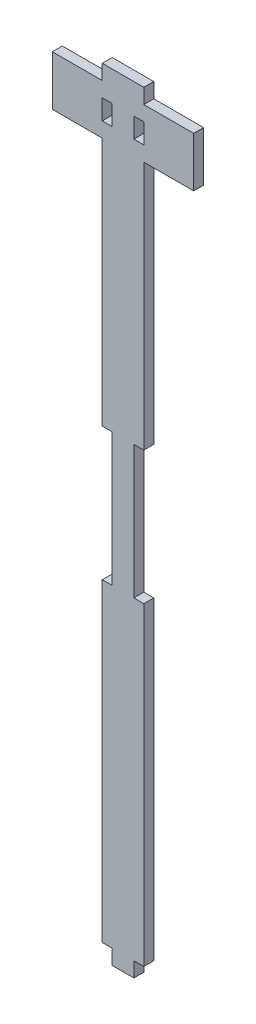
ISO-10303-21;
HEADER;
FILE_DESCRIPTION(('STEP AP214'),'2;1');
FILE_NAME('part.step','',(''),(''),'','','');
FILE_SCHEMA(('AUTOMOTIVE_DESIGN { 1 0 10303 214 1 1 1 1 }'));
ENDSEC;
DATA;
#1=APPLICATION_CONTEXT('core data for automotive mechanical design processes');
#2=APPLICATION_PROTOCOL_DEFINITION('international standard','automotive_design',2000,#1);
#3=PRODUCT_CONTEXT('',#1,'mechanical');
#4=PRODUCT('Part','Part','',(#3));
#5=PRODUCT_RELATED_PRODUCT_CATEGORY('part','',(#4));
#6=PRODUCT_DEFINITION_FORMATION('','',#4);
#7=PRODUCT_DEFINITION_CONTEXT('part definition',#1,'design');
#8=PRODUCT_DEFINITION('design','',#6,#7);
#9=PRODUCT_DEFINITION_SHAPE('','',#8);
#10=(LENGTH_UNIT() NAMED_UNIT(*) SI_UNIT(.MILLI.,.METRE.));
#11=(NAMED_UNIT(*) PLANE_ANGLE_UNIT() SI_UNIT($,.RADIAN.));
#12=(NAMED_UNIT(*) SI_UNIT($,.STERADIAN.) SOLID_ANGLE_UNIT());
#13=UNCERTAINTY_MEASURE_WITH_UNIT(LENGTH_MEASURE(1.E-05),#10,'distance_accuracy_value','');
#14=(GEOMETRIC_REPRESENTATION_CONTEXT(3) GLOBAL_UNCERTAINTY_ASSIGNED_CONTEXT((#13)) GLOBAL_UNIT_ASSIGNED_CONTEXT((#10,
#11,#12)) REPRESENTATION_CONTEXT('',''));
#15=CARTESIAN_POINT('',(0.,0.,0.));
#16=DIRECTION('',(0.,0.,1.));
#17=DIRECTION('',(1.,0.,0.));
#18=AXIS2_PLACEMENT_3D('',#15,#16,#17);
#19=CARTESIAN_POINT('',(0.,0.,3.));
#20=DIRECTION('',(0.,0.,1.));
#21=DIRECTION('',(1.,0.,0.));
#22=AXIS2_PLACEMENT_3D('',#19,#20,#21);
#23=PLANE('',#22);
#24=DIRECTION('',(1.,0.,0.));
#25=VECTOR('',#24,1.);
#26=CARTESIAN_POINT('',(6.37843131465865,-114.5,3.));
#27=LINE('',#26,#25);
#28=CARTESIAN_POINT('',(3.37843131465854,-114.5,3.));
#29=VERTEX_POINT('',#28);
#30=CARTESIAN_POINT('',(6.37843131465865,-114.5,3.));
#31=VERTEX_POINT('',#30);
#32=EDGE_CURVE('E314',#29,#31,#27,.T.);
#33=ORIENTED_EDGE('',*,*,#32,.T.);
#34=DIRECTION('',(0.,1.,0.));
#35=VECTOR('',#34,1.);
#36=CARTESIAN_POINT('',(6.37843131465865,-20.,3.));
#37=LINE('',#36,#35);
#38=CARTESIAN_POINT('',(6.37843131465865,-20.,3.));
#39=VERTEX_POINT('',#38);
#40=EDGE_CURVE('E317',#31,#39,#37,.T.);
#41=ORIENTED_EDGE('',*,*,#40,.T.);
#42=DIRECTION('',(-1.,0.,0.));
#43=VECTOR('',#42,1.);
#44=CARTESIAN_POINT('',(3.37843131465865,-20.,3.));
#45=LINE('',#44,#43);
#46=CARTESIAN_POINT('',(3.37843131465865,-20.,3.));
#47=VERTEX_POINT('',#46);
#48=EDGE_CURVE('E320',#39,#47,#45,.T.);
#49=ORIENTED_EDGE('',*,*,#48,.T.);
#50=DIRECTION('',(0.,1.,0.));
#51=VECTOR('',#50,1.);
#52=CARTESIAN_POINT('',(3.37843131465865,20.,3.));
#53=LINE('',#52,#51);
#54=CARTESIAN_POINT('',(3.37843131465865,20.,3.));
#55=VERTEX_POINT('',#54);
#56=EDGE_CURVE('E322',#47,#55,#53,.T.);
#57=ORIENTED_EDGE('',*,*,#56,.T.);
#58=DIRECTION('',(1.,0.,0.));
#59=VECTOR('',#58,1.);
#60=CARTESIAN_POINT('',(6.37843131465871,20.,3.));
#61=LINE('',#60,#59);
#62=CARTESIAN_POINT('',(6.37843131465871,20.,3.));
#63=VERTEX_POINT('',#62);
#64=EDGE_CURVE('E324',#55,#63,#61,.T.);
#65=ORIENTED_EDGE('',*,*,#64,.T.);
#66=DIRECTION('',(0.,1.,0.));
#67=VECTOR('',#66,1.);
#68=CARTESIAN_POINT('',(6.37843131465871,95.,3.));
#69=LINE('',#68,#67);
#70=CARTESIAN_POINT('',(6.37843131465871,95.,3.));
#71=VERTEX_POINT('',#70);
#72=EDGE_CURVE('E326',#63,#71,#69,.T.);
#73=ORIENTED_EDGE('',*,*,#72,.T.);
#74=DIRECTION('',(1.,0.,0.));
#75=VECTOR('',#74,1.);
#76=CARTESIAN_POINT('',(6.37843131465871,95.,3.));
#77=LINE('',#76,#75);
#78=CARTESIAN_POINT('',(21.3784313146587,95.,3.));
#79=VERTEX_POINT('',#78);
#80=EDGE_CURVE('E328',#71,#79,#77,.T.);
#81=ORIENTED_EDGE('',*,*,#80,.T.);
#82=DIRECTION('',(0.,1.,0.));
#83=VECTOR('',#82,1.);
#84=CARTESIAN_POINT('',(21.3784313146587,110.,3.));
#85=LINE('',#84,#83);
#86=CARTESIAN_POINT('',(21.3784313146587,110.,3.));
#87=VERTEX_POINT('',#86);
#88=EDGE_CURVE('E330',#79,#87,#85,.T.);
#89=ORIENTED_EDGE('',*,*,#88,.T.);
#90=DIRECTION('',(-1.,0.,0.));
#91=VECTOR('',#90,1.);
#92=CARTESIAN_POINT('',(6.37843131465871,110.,3.));
#93=LINE('',#92,#91);
#94=CARTESIAN_POINT('',(6.37843131465871,110.,3.));
#95=VERTEX_POINT('',#94);
#96=EDGE_CURVE('E332',#87,#95,#93,.T.);
#97=ORIENTED_EDGE('',*,*,#96,.T.);
#98=DIRECTION('',(0.,1.,0.));
#99=VECTOR('',#98,1.);
#100=CARTESIAN_POINT('',(6.37843131465871,110.,3.));
#101=LINE('',#100,#99);
#102=CARTESIAN_POINT('',(6.37843131465871,114.5,3.));
#103=VERTEX_POINT('',#102);
#104=EDGE_CURVE('E334',#95,#103,#101,.T.);
#105=ORIENTED_EDGE('',*,*,#104,.T.);
#106=DIRECTION('',(-1.,0.,0.));
#107=VECTOR('',#106,1.);
#108=CARTESIAN_POINT('',(6.37843131465871,114.5,3.));
#109=LINE('',#108,#107);
#110=CARTESIAN_POINT('',(-6.12156868534136,114.5,3.));
#111=VERTEX_POINT('',#110);
#112=EDGE_CURVE('E336',#103,#111,#109,.T.);
#113=ORIENTED_EDGE('',*,*,#112,.T.);
#114=DIRECTION('',(0.,-1.,0.));
#115=VECTOR('',#114,1.);
#116=CARTESIAN_POINT('',(-6.12156868534136,114.5,3.));
#117=LINE('',#116,#115);
#118=CARTESIAN_POINT('',(-6.12156868534136,110.,3.));
#119=VERTEX_POINT('',#118);
#120=EDGE_CURVE('E338',#111,#119,#117,.T.);
#121=ORIENTED_EDGE('',*,*,#120,.T.);
#122=DIRECTION('',(-1.,0.,0.));
#123=VECTOR('',#122,1.);
#124=CARTESIAN_POINT('',(-21.1215686853414,110.,3.));
#125=LINE('',#124,#123);
#126=CARTESIAN_POINT('',(-21.1215686853414,110.,3.));
#127=VERTEX_POINT('',#126);
#128=EDGE_CURVE('E340',#119,#127,#125,.T.);
#129=ORIENTED_EDGE('',*,*,#128,.T.);
#130=DIRECTION('',(0.,-1.,0.));
#131=VECTOR('',#130,1.);
#132=CARTESIAN_POINT('',(-21.1215686853414,95.,3.));
#133=LINE('',#132,#131);
#134=CARTESIAN_POINT('',(-21.1215686853414,95.,3.));
#135=VERTEX_POINT('',#134);
#136=EDGE_CURVE('E342',#127,#135,#133,.T.);
#137=ORIENTED_EDGE('',*,*,#136,.T.);
#138=DIRECTION('',(1.,0.,0.));
#139=VECTOR('',#138,1.);
#140=CARTESIAN_POINT('',(-21.1215686853414,95.,3.));
#141=LINE('',#140,#139);
#142=CARTESIAN_POINT('',(-6.12156868534136,95.,3.));
#143=VERTEX_POINT('',#142);
#144=EDGE_CURVE('E344',#135,#143,#141,.T.);
#145=ORIENTED_EDGE('',*,*,#144,.T.);
#146=DIRECTION('',(0.,-1.,0.));
#147=VECTOR('',#146,1.);
#148=CARTESIAN_POINT('',(-6.12156868534136,20.,3.));
#149=LINE('',#148,#147);
#150=CARTESIAN_POINT('',(-6.12156868534136,20.,3.));
#151=VERTEX_POINT('',#150);
#152=EDGE_CURVE('E346',#143,#151,#149,.T.);
#153=ORIENTED_EDGE('',*,*,#152,.T.);
#154=DIRECTION('',(1.,0.,0.));
#155=VECTOR('',#154,1.);
#156=CARTESIAN_POINT('',(-6.12156868534136,20.,3.));
#157=LINE('',#156,#155);
#158=CARTESIAN_POINT('',(-3.12156868534152,20.,3.));
#159=VERTEX_POINT('',#158);
#160=EDGE_CURVE('E348',#151,#159,#157,.T.);
#161=ORIENTED_EDGE('',*,*,#160,.T.);
#162=DIRECTION('',(0.,-1.,0.));
#163=VECTOR('',#162,1.);
#164=CARTESIAN_POINT('',(-3.12156868534152,20.,3.));
#165=LINE('',#164,#163);
#166=CARTESIAN_POINT('',(-3.12156868534152,-20.,3.));
#167=VERTEX_POINT('',#166);
#168=EDGE_CURVE('E350',#159,#167,#165,.T.);
#169=ORIENTED_EDGE('',*,*,#168,.T.);
#170=DIRECTION('',(-1.,0.,0.));
#171=VECTOR('',#170,1.);
#172=CARTESIAN_POINT('',(-3.12156868534152,-20.,3.));
#173=LINE('',#172,#171);
#174=CARTESIAN_POINT('',(-6.12156868534147,-20.,3.));
#175=VERTEX_POINT('',#174);
#176=EDGE_CURVE('E352',#167,#175,#173,.T.);
#177=ORIENTED_EDGE('',*,*,#176,.T.);
#178=DIRECTION('',(0.,-1.,0.));
#179=VECTOR('',#178,1.);
#180=CARTESIAN_POINT('',(-6.12156868534147,-20.,3.));
#181=LINE('',#180,#179);
#182=CARTESIAN_POINT('',(-6.12156868534147,-114.5,3.));
#183=VERTEX_POINT('',#182);
#184=EDGE_CURVE('E354',#175,#183,#181,.T.);
#185=ORIENTED_EDGE('',*,*,#184,.T.);
#186=DIRECTION('',(1.,0.,0.));
#187=VECTOR('',#186,1.);
#188=CARTESIAN_POINT('',(-3.12156868534147,-114.5,3.));
#189=LINE('',#188,#187);
#190=CARTESIAN_POINT('',(-3.12156868534147,-114.5,3.));
#191=VERTEX_POINT('',#190);
#192=EDGE_CURVE('E356',#183,#191,#189,.T.);
#193=ORIENTED_EDGE('',*,*,#192,.T.);
#194=DIRECTION('',(0.,-1.,0.));
#195=VECTOR('',#194,1.);
#196=CARTESIAN_POINT('',(-3.12156868534147,-119.,3.));
#197=LINE('',#196,#195);
#198=CARTESIAN_POINT('',(-3.12156868534147,-119.,3.));
#199=VERTEX_POINT('',#198);
#200=EDGE_CURVE('E358',#191,#199,#197,.T.);
#201=ORIENTED_EDGE('',*,*,#200,.T.);
#202=DIRECTION('',(1.,0.,0.));
#203=VECTOR('',#202,1.);
#204=CARTESIAN_POINT('',(3.37843131465854,-119.,3.));
#205=LINE('',#204,#203);
#206=CARTESIAN_POINT('',(3.37843131465854,-119.,3.));
#207=VERTEX_POINT('',#206);
#208=EDGE_CURVE('E360',#199,#207,#205,.T.);
#209=ORIENTED_EDGE('',*,*,#208,.T.);
#210=DIRECTION('',(0.,1.,0.));
#211=VECTOR('',#210,1.);
#212=CARTESIAN_POINT('',(3.37843131465854,-114.5,3.));
#213=LINE('',#212,#211);
#214=EDGE_CURVE('E362',#207,#29,#213,.T.);
#215=ORIENTED_EDGE('',*,*,#214,.T.);
#216=EDGE_LOOP('',(#33,#41,#49,#57,#65,#73,#81,#89,#97,#105,#113,#121,#129,#137,#145,#153,#161,
#169,#177,#185,#193,#201,#209,#215));
#217=FACE_BOUND('',#216,.T.);
#218=DIRECTION('',(0.,1.,0.));
#219=VECTOR('',#218,1.);
#220=CARTESIAN_POINT('',(6.37843131465871,99.5,3.));
#221=LINE('',#220,#219);
#222=CARTESIAN_POINT('',(6.37843131465871,99.5,3.));
#223=VERTEX_POINT('',#222);
#224=CARTESIAN_POINT('',(6.37843131465871,105.5,3.));
#225=VERTEX_POINT('',#224);
#226=EDGE_CURVE('E285',#223,#225,#221,.T.);
#227=ORIENTED_EDGE('',*,*,#226,.F.);
#228=DIRECTION('',(1.,0.,0.));
#229=VECTOR('',#228,1.);
#230=CARTESIAN_POINT('',(6.37843131465871,99.5,3.));
#231=LINE('',#230,#229);
#232=CARTESIAN_POINT('',(3.3784313146587,99.5,3.));
#233=VERTEX_POINT('',#232);
#234=EDGE_CURVE('E283',#233,#223,#231,.T.);
#235=ORIENTED_EDGE('',*,*,#234,.F.);
#236=DIRECTION('',(0.,-1.,0.));
#237=VECTOR('',#236,1.);
#238=CARTESIAN_POINT('',(3.3784313146587,105.5,3.));
#239=LINE('',#238,#237);
#240=CARTESIAN_POINT('',(3.3784313146587,105.5,3.));
#241=VERTEX_POINT('',#240);
#242=EDGE_CURVE('E291',#241,#233,#239,.T.);
#243=ORIENTED_EDGE('',*,*,#242,.F.);
#244=DIRECTION('',(-1.,0.,0.));
#245=VECTOR('',#244,1.);
#246=CARTESIAN_POINT('',(6.37843131465871,105.5,3.));
#247=LINE('',#246,#245);
#248=EDGE_CURVE('E288',#225,#241,#247,.T.);
#249=ORIENTED_EDGE('',*,*,#248,.F.);
#250=EDGE_LOOP('',(#227,#235,#243,#249));
#251=FACE_BOUND('',#250,.T.);
#252=DIRECTION('',(1.,0.,0.));
#253=VECTOR('',#252,1.);
#254=CARTESIAN_POINT('',(-6.12156868534136,99.5,3.));
#255=LINE('',#254,#253);
#256=CARTESIAN_POINT('',(-6.12156868534136,99.5,3.));
#257=VERTEX_POINT('',#256);
#258=CARTESIAN_POINT('',(-3.12156868534136,99.5,3.));
#259=VERTEX_POINT('',#258);
#260=EDGE_CURVE('E255',#257,#259,#255,.T.);
#261=ORIENTED_EDGE('',*,*,#260,.F.);
#262=DIRECTION('',(0.,-1.,0.));
#263=VECTOR('',#262,1.);
#264=CARTESIAN_POINT('',(-6.12156868534136,99.5,3.));
#265=LINE('',#264,#263);
#266=CARTESIAN_POINT('',(-6.12156868534136,105.5,3.));
#267=VERTEX_POINT('',#266);
#268=EDGE_CURVE('E247',#267,#257,#265,.T.);
#269=ORIENTED_EDGE('',*,*,#268,.F.);
#270=DIRECTION('',(-1.,0.,0.));
#271=VECTOR('',#270,1.);
#272=CARTESIAN_POINT('',(-6.12156868534136,105.5,3.));
#273=LINE('',#272,#271);
#274=CARTESIAN_POINT('',(-3.12156868534136,105.5,3.));
#275=VERTEX_POINT('',#274);
#276=EDGE_CURVE('E269',#275,#267,#273,.T.);
#277=ORIENTED_EDGE('',*,*,#276,.F.);
#278=DIRECTION('',(0.,1.,0.));
#279=VECTOR('',#278,1.);
#280=CARTESIAN_POINT('',(-3.12156868534136,105.5,3.));
#281=LINE('',#280,#279);
#282=EDGE_CURVE('E267',#259,#275,#281,.T.);
#283=ORIENTED_EDGE('',*,*,#282,.F.);
#284=EDGE_LOOP('',(#261,#269,#277,#283));
#285=FACE_BOUND('',#284,.T.);
#286=ADVANCED_FACE('F38',(#217,#251,#285),#23,.T.);
#287=CARTESIAN_POINT('',(0.,0.,0.));
#288=DIRECTION('',(0.,0.,1.));
#289=DIRECTION('',(1.,0.,0.));
#290=AXIS2_PLACEMENT_3D('',#287,#288,#289);
#291=PLANE('',#290);
#292=DIRECTION('',(1.,0.,0.));
#293=VECTOR('',#292,1.);
#294=CARTESIAN_POINT('',(6.37843131465871,99.5,0.));
#295=LINE('',#294,#293);
#296=CARTESIAN_POINT('',(3.3784313146587,99.5,0.));
#297=VERTEX_POINT('',#296);
#298=CARTESIAN_POINT('',(6.37843131465871,99.5,0.));
#299=VERTEX_POINT('',#298);
#300=EDGE_CURVE('E263',#297,#299,#295,.T.);
#301=ORIENTED_EDGE('',*,*,#300,.T.);
#302=DIRECTION('',(0.,1.,0.));
#303=VECTOR('',#302,1.);
#304=CARTESIAN_POINT('',(6.37843131465871,99.5,0.));
#305=LINE('',#304,#303);
#306=CARTESIAN_POINT('',(6.37843131465871,105.5,0.));
#307=VERTEX_POINT('',#306);
#308=EDGE_CURVE('E296',#299,#307,#305,.T.);
#309=ORIENTED_EDGE('',*,*,#308,.T.);
#310=DIRECTION('',(-1.,0.,0.));
#311=VECTOR('',#310,1.);
#312=CARTESIAN_POINT('',(6.37843131465871,105.5,0.));
#313=LINE('',#312,#311);
#314=CARTESIAN_POINT('',(3.3784313146587,105.5,0.));
#315=VERTEX_POINT('',#314);
#316=EDGE_CURVE('E299',#307,#315,#313,.T.);
#317=ORIENTED_EDGE('',*,*,#316,.T.);
#318=DIRECTION('',(0.,-1.,0.));
#319=VECTOR('',#318,1.);
#320=CARTESIAN_POINT('',(3.3784313146587,105.5,0.));
#321=LINE('',#320,#319);
#322=EDGE_CURVE('E286',#315,#297,#321,.T.);
#323=ORIENTED_EDGE('',*,*,#322,.T.);
#324=EDGE_LOOP('',(#301,#309,#317,#323));
#325=FACE_BOUND('',#324,.T.);
#326=DIRECTION('',(1.,0.,0.));
#327=VECTOR('',#326,1.);
#328=CARTESIAN_POINT('',(6.37843131465865,-114.5,0.));
#329=LINE('',#328,#327);
#330=CARTESIAN_POINT('',(3.37843131465854,-114.5,0.));
#331=VERTEX_POINT('',#330);
#332=CARTESIAN_POINT('',(6.37843131465865,-114.5,0.));
#333=VERTEX_POINT('',#332);
#334=EDGE_CURVE('E313',#331,#333,#329,.T.);
#335=ORIENTED_EDGE('',*,*,#334,.F.);
#336=DIRECTION('',(0.,1.,0.));
#337=VECTOR('',#336,1.);
#338=CARTESIAN_POINT('',(3.37843131465854,-114.5,0.));
#339=LINE('',#338,#337);
#340=CARTESIAN_POINT('',(3.37843131465854,-119.,0.));
#341=VERTEX_POINT('',#340);
#342=EDGE_CURVE('E318',#341,#331,#339,.T.);
#343=ORIENTED_EDGE('',*,*,#342,.F.);
#344=DIRECTION('',(1.,0.,0.));
#345=VECTOR('',#344,1.);
#346=CARTESIAN_POINT('',(3.37843131465854,-119.,0.));
#347=LINE('',#346,#345);
#348=CARTESIAN_POINT('',(-3.12156868534147,-119.,0.));
#349=VERTEX_POINT('',#348);
#350=EDGE_CURVE('E409',#349,#341,#347,.T.);
#351=ORIENTED_EDGE('',*,*,#350,.F.);
#352=DIRECTION('',(0.,-1.,0.));
#353=VECTOR('',#352,1.);
#354=CARTESIAN_POINT('',(-3.12156868534147,-119.,0.));
#355=LINE('',#354,#353);
#356=CARTESIAN_POINT('',(-3.12156868534147,-114.5,0.));
#357=VERTEX_POINT('',#356);
#358=EDGE_CURVE('E407',#357,#349,#355,.T.);
#359=ORIENTED_EDGE('',*,*,#358,.F.);
#360=DIRECTION('',(1.,0.,0.));
#361=VECTOR('',#360,1.);
#362=CARTESIAN_POINT('',(-3.12156868534147,-114.5,0.));
#363=LINE('',#362,#361);
#364=CARTESIAN_POINT('',(-6.12156868534147,-114.5,0.));
#365=VERTEX_POINT('',#364);
#366=EDGE_CURVE('E405',#365,#357,#363,.T.);
#367=ORIENTED_EDGE('',*,*,#366,.F.);
#368=DIRECTION('',(0.,-1.,0.));
#369=VECTOR('',#368,1.);
#370=CARTESIAN_POINT('',(-6.12156868534147,-20.,0.));
#371=LINE('',#370,#369);
#372=CARTESIAN_POINT('',(-6.12156868534147,-20.,0.));
#373=VERTEX_POINT('',#372);
#374=EDGE_CURVE('E403',#373,#365,#371,.T.);
#375=ORIENTED_EDGE('',*,*,#374,.F.);
#376=DIRECTION('',(-1.,0.,0.));
#377=VECTOR('',#376,1.);
#378=CARTESIAN_POINT('',(-3.12156868534152,-20.,0.));
#379=LINE('',#378,#377);
#380=CARTESIAN_POINT('',(-3.12156868534152,-20.,0.));
#381=VERTEX_POINT('',#380);
#382=EDGE_CURVE('E401',#381,#373,#379,.T.);
#383=ORIENTED_EDGE('',*,*,#382,.F.);
#384=DIRECTION('',(0.,-1.,0.));
#385=VECTOR('',#384,1.);
#386=CARTESIAN_POINT('',(-3.12156868534152,20.,0.));
#387=LINE('',#386,#385);
#388=CARTESIAN_POINT('',(-3.12156868534152,20.,0.));
#389=VERTEX_POINT('',#388);
#390=EDGE_CURVE('E399',#389,#381,#387,.T.);
#391=ORIENTED_EDGE('',*,*,#390,.F.);
#392=DIRECTION('',(1.,0.,0.));
#393=VECTOR('',#392,1.);
#394=CARTESIAN_POINT('',(-6.12156868534136,20.,0.));
#395=LINE('',#394,#393);
#396=CARTESIAN_POINT('',(-6.12156868534136,20.,0.));
#397=VERTEX_POINT('',#396);
#398=EDGE_CURVE('E397',#397,#389,#395,.T.);
#399=ORIENTED_EDGE('',*,*,#398,.F.);
#400=DIRECTION('',(0.,-1.,0.));
#401=VECTOR('',#400,1.);
#402=CARTESIAN_POINT('',(-6.12156868534136,20.,0.));
#403=LINE('',#402,#401);
#404=CARTESIAN_POINT('',(-6.12156868534136,95.,0.));
#405=VERTEX_POINT('',#404);
#406=EDGE_CURVE('E395',#405,#397,#403,.T.);
#407=ORIENTED_EDGE('',*,*,#406,.F.);
#408=DIRECTION('',(1.,0.,0.));
#409=VECTOR('',#408,1.);
#410=CARTESIAN_POINT('',(-21.1215686853414,95.,0.));
#411=LINE('',#410,#409);
#412=CARTESIAN_POINT('',(-21.1215686853414,95.,0.));
#413=VERTEX_POINT('',#412);
#414=EDGE_CURVE('E393',#413,#405,#411,.T.);
#415=ORIENTED_EDGE('',*,*,#414,.F.);
#416=DIRECTION('',(0.,-1.,0.));
#417=VECTOR('',#416,1.);
#418=CARTESIAN_POINT('',(-21.1215686853414,95.,0.));
#419=LINE('',#418,#417);
#420=CARTESIAN_POINT('',(-21.1215686853414,110.,0.));
#421=VERTEX_POINT('',#420);
#422=EDGE_CURVE('E391',#421,#413,#419,.T.);
#423=ORIENTED_EDGE('',*,*,#422,.F.);
#424=DIRECTION('',(-1.,0.,0.));
#425=VECTOR('',#424,1.);
#426=CARTESIAN_POINT('',(-21.1215686853414,110.,0.));
#427=LINE('',#426,#425);
#428=CARTESIAN_POINT('',(-6.12156868534136,110.,0.));
#429=VERTEX_POINT('',#428);
#430=EDGE_CURVE('E389',#429,#421,#427,.T.);
#431=ORIENTED_EDGE('',*,*,#430,.F.);
#432=DIRECTION('',(0.,-1.,0.));
#433=VECTOR('',#432,1.);
#434=CARTESIAN_POINT('',(-6.12156868534136,114.5,0.));
#435=LINE('',#434,#433);
#436=CARTESIAN_POINT('',(-6.12156868534136,114.5,0.));
#437=VERTEX_POINT('',#436);
#438=EDGE_CURVE('E387',#437,#429,#435,.T.);
#439=ORIENTED_EDGE('',*,*,#438,.F.);
#440=DIRECTION('',(-1.,0.,0.));
#441=VECTOR('',#440,1.);
#442=CARTESIAN_POINT('',(6.37843131465871,114.5,0.));
#443=LINE('',#442,#441);
#444=CARTESIAN_POINT('',(6.37843131465871,114.5,0.));
#445=VERTEX_POINT('',#444);
#446=EDGE_CURVE('E385',#445,#437,#443,.T.);
#447=ORIENTED_EDGE('',*,*,#446,.F.);
#448=DIRECTION('',(0.,1.,0.));
#449=VECTOR('',#448,1.);
#450=CARTESIAN_POINT('',(6.37843131465871,110.,0.));
#451=LINE('',#450,#449);
#452=CARTESIAN_POINT('',(6.37843131465871,110.,0.));
#453=VERTEX_POINT('',#452);
#454=EDGE_CURVE('E383',#453,#445,#451,.T.);
#455=ORIENTED_EDGE('',*,*,#454,.F.);
#456=DIRECTION('',(-1.,0.,0.));
#457=VECTOR('',#456,1.);
#458=CARTESIAN_POINT('',(6.37843131465871,110.,0.));
#459=LINE('',#458,#457);
#460=CARTESIAN_POINT('',(21.3784313146587,110.,0.));
#461=VERTEX_POINT('',#460);
#462=EDGE_CURVE('E381',#461,#453,#459,.T.);
#463=ORIENTED_EDGE('',*,*,#462,.F.);
#464=DIRECTION('',(0.,1.,0.));
#465=VECTOR('',#464,1.);
#466=CARTESIAN_POINT('',(21.3784313146587,110.,0.));
#467=LINE('',#466,#465);
#468=CARTESIAN_POINT('',(21.3784313146587,95.,0.));
#469=VERTEX_POINT('',#468);
#470=EDGE_CURVE('E379',#469,#461,#467,.T.);
#471=ORIENTED_EDGE('',*,*,#470,.F.);
#472=DIRECTION('',(1.,0.,0.));
#473=VECTOR('',#472,1.);
#474=CARTESIAN_POINT('',(6.37843131465871,95.,0.));
#475=LINE('',#474,#473);
#476=CARTESIAN_POINT('',(6.37843131465871,95.,0.));
#477=VERTEX_POINT('',#476);
#478=EDGE_CURVE('E377',#477,#469,#475,.T.);
#479=ORIENTED_EDGE('',*,*,#478,.F.);
#480=DIRECTION('',(0.,1.,0.));
#481=VECTOR('',#480,1.);
#482=CARTESIAN_POINT('',(6.37843131465871,95.,0.));
#483=LINE('',#482,#481);
#484=CARTESIAN_POINT('',(6.37843131465871,20.,0.));
#485=VERTEX_POINT('',#484);
#486=EDGE_CURVE('E375',#485,#477,#483,.T.);
#487=ORIENTED_EDGE('',*,*,#486,.F.);
#488=DIRECTION('',(1.,0.,0.));
#489=VECTOR('',#488,1.);
#490=CARTESIAN_POINT('',(6.37843131465871,20.,0.));
#491=LINE('',#490,#489);
#492=CARTESIAN_POINT('',(3.37843131465865,20.,0.));
#493=VERTEX_POINT('',#492);
#494=EDGE_CURVE('E373',#493,#485,#491,.T.);
#495=ORIENTED_EDGE('',*,*,#494,.F.);
#496=DIRECTION('',(0.,1.,0.));
#497=VECTOR('',#496,1.);
#498=CARTESIAN_POINT('',(3.37843131465865,20.,0.));
#499=LINE('',#498,#497);
#500=CARTESIAN_POINT('',(3.37843131465865,-20.,0.));
#501=VERTEX_POINT('',#500);
#502=EDGE_CURVE('E371',#501,#493,#499,.T.);
#503=ORIENTED_EDGE('',*,*,#502,.F.);
#504=DIRECTION('',(-1.,0.,0.));
#505=VECTOR('',#504,1.);
#506=CARTESIAN_POINT('',(3.37843131465865,-20.,0.));
#507=LINE('',#506,#505);
#508=CARTESIAN_POINT('',(6.37843131465865,-20.,0.));
#509=VERTEX_POINT('',#508);
#510=EDGE_CURVE('E369',#509,#501,#507,.T.);
#511=ORIENTED_EDGE('',*,*,#510,.F.);
#512=DIRECTION('',(0.,1.,0.));
#513=VECTOR('',#512,1.);
#514=CARTESIAN_POINT('',(6.37843131465865,-20.,0.));
#515=LINE('',#514,#513);
#516=EDGE_CURVE('E367',#333,#509,#515,.T.);
#517=ORIENTED_EDGE('',*,*,#516,.F.);
#518=EDGE_LOOP('',(#335,#343,#351,#359,#367,#375,#383,#391,#399,#407,#415,#423,#431,#439,#447,
#455,#463,#471,#479,#487,#495,#503,#511,#517));
#519=FACE_BOUND('',#518,.T.);
#520=DIRECTION('',(0.,-1.,0.));
#521=VECTOR('',#520,1.);
#522=CARTESIAN_POINT('',(-6.12156868534136,99.5,0.));
#523=LINE('',#522,#521);
#524=CARTESIAN_POINT('',(-6.12156868534136,105.5,0.));
#525=VERTEX_POINT('',#524);
#526=CARTESIAN_POINT('',(-6.12156868534136,99.5,0.));
#527=VERTEX_POINT('',#526);
#528=EDGE_CURVE('E61',#525,#527,#523,.T.);
#529=ORIENTED_EDGE('',*,*,#528,.T.);
#530=DIRECTION('',(1.,0.,0.));
#531=VECTOR('',#530,1.);
#532=CARTESIAN_POINT('',(-6.12156868534136,99.5,0.));
#533=LINE('',#532,#531);
#534=CARTESIAN_POINT('',(-3.12156868534136,99.5,0.));
#535=VERTEX_POINT('',#534);
#536=EDGE_CURVE('E262',#527,#535,#533,.T.);
#537=ORIENTED_EDGE('',*,*,#536,.T.);
#538=DIRECTION('',(0.,1.,0.));
#539=VECTOR('',#538,1.);
#540=CARTESIAN_POINT('',(-3.12156868534136,105.5,0.));
#541=LINE('',#540,#539);
#542=CARTESIAN_POINT('',(-3.12156868534136,105.5,0.));
#543=VERTEX_POINT('',#542);
#544=EDGE_CURVE('E275',#535,#543,#541,.T.);
#545=ORIENTED_EDGE('',*,*,#544,.T.);
#546=DIRECTION('',(-1.,0.,0.));
#547=VECTOR('',#546,1.);
#548=CARTESIAN_POINT('',(-6.12156868534136,105.5,0.));
#549=LINE('',#548,#547);
#550=EDGE_CURVE('E256',#543,#525,#549,.T.);
#551=ORIENTED_EDGE('',*,*,#550,.T.);
#552=EDGE_LOOP('',(#529,#537,#545,#551));
#553=FACE_BOUND('',#552,.T.);
#554=ADVANCED_FACE('F487',(#325,#519,#553),#291,.F.);
#555=CARTESIAN_POINT('',(6.37843131465865,-114.5,3.));
#556=DIRECTION('',(0.,1.,0.));
#557=DIRECTION('',(0.,0.,1.));
#558=AXIS2_PLACEMENT_3D('',#555,#556,#557);
#559=PLANE('',#558);
#560=ORIENTED_EDGE('',*,*,#334,.T.);
#561=DIRECTION('',(0.,0.,-1.));
#562=VECTOR('',#561,1.);
#563=CARTESIAN_POINT('',(6.37843131465865,-114.5,3.));
#564=LINE('',#563,#562);
#565=EDGE_CURVE('E11',#31,#333,#564,.T.);
#566=ORIENTED_EDGE('',*,*,#565,.F.);
#567=ORIENTED_EDGE('',*,*,#32,.F.);
#568=DIRECTION('',(0.,0.,-1.));
#569=VECTOR('',#568,1.);
#570=CARTESIAN_POINT('',(3.37843131465854,-114.5,3.));
#571=LINE('',#570,#569);
#572=EDGE_CURVE('E364',#29,#331,#571,.T.);
#573=ORIENTED_EDGE('',*,*,#572,.T.);
#574=EDGE_LOOP('',(#560,#566,#567,#573));
#575=FACE_BOUND('',#574,.T.);
#576=ADVANCED_FACE('F40',(#575),#559,.F.);
#577=CARTESIAN_POINT('',(6.37843131465865,-20.,3.));
#578=DIRECTION('',(-1.,0.,0.));
#579=DIRECTION('',(0.,0.,1.));
#580=AXIS2_PLACEMENT_3D('',#577,#578,#579);
#581=PLANE('',#580);
#582=ORIENTED_EDGE('',*,*,#516,.T.);
#583=DIRECTION('',(0.,0.,-1.));
#584=VECTOR('',#583,1.);
#585=CARTESIAN_POINT('',(6.37843131465865,-20.,3.));
#586=LINE('',#585,#584);
#587=EDGE_CURVE('E46',#39,#509,#586,.T.);
#588=ORIENTED_EDGE('',*,*,#587,.F.);
#589=ORIENTED_EDGE('',*,*,#40,.F.);
#590=ORIENTED_EDGE('',*,*,#565,.T.);
#591=EDGE_LOOP('',(#582,#588,#589,#590));
#592=FACE_BOUND('',#591,.T.);
#593=ADVANCED_FACE('F505',(#592),#581,.F.);
#594=CARTESIAN_POINT('',(3.37843131465865,-20.,3.));
#595=DIRECTION('',(0.,-1.,0.));
#596=DIRECTION('',(0.,0.,-1.));
#597=AXIS2_PLACEMENT_3D('',#594,#595,#596);
#598=PLANE('',#597);
#599=ORIENTED_EDGE('',*,*,#510,.T.);
#600=DIRECTION('',(0.,0.,-1.));
#601=VECTOR('',#600,1.);
#602=CARTESIAN_POINT('',(3.37843131465865,-20.,3.));
#603=LINE('',#602,#601);
#604=EDGE_CURVE('E474',#47,#501,#603,.T.);
#605=ORIENTED_EDGE('',*,*,#604,.F.);
#606=ORIENTED_EDGE('',*,*,#48,.F.);
#607=ORIENTED_EDGE('',*,*,#587,.T.);
#608=EDGE_LOOP('',(#599,#605,#606,#607));
#609=FACE_BOUND('',#608,.T.);
#610=ADVANCED_FACE('F481',(#609),#598,.F.);
#611=CARTESIAN_POINT('',(3.37843131465865,20.,3.));
#612=DIRECTION('',(-1.,0.,0.));
#613=DIRECTION('',(0.,0.,1.));
#614=AXIS2_PLACEMENT_3D('',#611,#612,#613);
#615=PLANE('',#614);
#616=ORIENTED_EDGE('',*,*,#502,.T.);
#617=DIRECTION('',(0.,0.,-1.));
#618=VECTOR('',#617,1.);
#619=CARTESIAN_POINT('',(3.37843131465865,20.,3.));
#620=LINE('',#619,#618);
#621=EDGE_CURVE('E471',#55,#493,#620,.T.);
#622=ORIENTED_EDGE('',*,*,#621,.F.);
#623=ORIENTED_EDGE('',*,*,#56,.F.);
#624=ORIENTED_EDGE('',*,*,#604,.T.);
#625=EDGE_LOOP('',(#616,#622,#623,#624));
#626=FACE_BOUND('',#625,.T.);
#627=ADVANCED_FACE('F493',(#626),#615,.F.);
#628=CARTESIAN_POINT('',(6.37843131465871,20.,3.));
#629=DIRECTION('',(0.,1.,0.));
#630=DIRECTION('',(0.,0.,1.));
#631=AXIS2_PLACEMENT_3D('',#628,#629,#630);
#632=PLANE('',#631);
#633=ORIENTED_EDGE('',*,*,#494,.T.);
#634=DIRECTION('',(0.,0.,-1.));
#635=VECTOR('',#634,1.);
#636=CARTESIAN_POINT('',(6.37843131465871,20.,3.));
#637=LINE('',#636,#635);
#638=EDGE_CURVE('E468',#63,#485,#637,.T.);
#639=ORIENTED_EDGE('',*,*,#638,.F.);
#640=ORIENTED_EDGE('',*,*,#64,.F.);
#641=ORIENTED_EDGE('',*,*,#621,.T.);
#642=EDGE_LOOP('',(#633,#639,#640,#641));
#643=FACE_BOUND('',#642,.T.);
#644=ADVANCED_FACE('F497',(#643),#632,.F.);
#645=CARTESIAN_POINT('',(6.37843131465871,95.,3.));
#646=DIRECTION('',(-1.,0.,0.));
#647=DIRECTION('',(0.,0.,1.));
#648=AXIS2_PLACEMENT_3D('',#645,#646,#647);
#649=PLANE('',#648);
#650=ORIENTED_EDGE('',*,*,#486,.T.);
#651=DIRECTION('',(0.,0.,-1.));
#652=VECTOR('',#651,1.);
#653=CARTESIAN_POINT('',(6.37843131465871,95.,3.));
#654=LINE('',#653,#652);
#655=EDGE_CURVE('E465',#71,#477,#654,.T.);
#656=ORIENTED_EDGE('',*,*,#655,.F.);
#657=ORIENTED_EDGE('',*,*,#72,.F.);
#658=ORIENTED_EDGE('',*,*,#638,.T.);
#659=EDGE_LOOP('',(#650,#656,#657,#658));
#660=FACE_BOUND('',#659,.T.);
#661=ADVANCED_FACE('F598',(#660),#649,.F.);
#662=CARTESIAN_POINT('',(6.37843131465871,95.,3.));
#663=DIRECTION('',(0.,1.,0.));
#664=DIRECTION('',(0.,0.,1.));
#665=AXIS2_PLACEMENT_3D('',#662,#663,#664);
#666=PLANE('',#665);
#667=ORIENTED_EDGE('',*,*,#478,.T.);
#668=DIRECTION('',(0.,0.,-1.));
#669=VECTOR('',#668,1.);
#670=CARTESIAN_POINT('',(21.3784313146587,95.,3.));
#671=LINE('',#670,#669);
#672=EDGE_CURVE('E462',#79,#469,#671,.T.);
#673=ORIENTED_EDGE('',*,*,#672,.F.);
#674=ORIENTED_EDGE('',*,*,#80,.F.);
#675=ORIENTED_EDGE('',*,*,#655,.T.);
#676=EDGE_LOOP('',(#667,#673,#674,#675));
#677=FACE_BOUND('',#676,.T.);
#678=ADVANCED_FACE('F596',(#677),#666,.F.);
#679=CARTESIAN_POINT('',(21.3784313146587,110.,3.));
#680=DIRECTION('',(-1.,0.,0.));
#681=DIRECTION('',(0.,0.,1.));
#682=AXIS2_PLACEMENT_3D('',#679,#680,#681);
#683=PLANE('',#682);
#684=ORIENTED_EDGE('',*,*,#470,.T.);
#685=DIRECTION('',(0.,0.,-1.));
#686=VECTOR('',#685,1.);
#687=CARTESIAN_POINT('',(21.3784313146587,110.,3.));
#688=LINE('',#687,#686);
#689=EDGE_CURVE('E459',#87,#461,#688,.T.);
#690=ORIENTED_EDGE('',*,*,#689,.F.);
#691=ORIENTED_EDGE('',*,*,#88,.F.);
#692=ORIENTED_EDGE('',*,*,#672,.T.);
#693=EDGE_LOOP('',(#684,#690,#691,#692));
#694=FACE_BOUND('',#693,.T.);
#695=ADVANCED_FACE('F592',(#694),#683,.F.);
#696=CARTESIAN_POINT('',(6.37843131465871,110.,3.));
#697=DIRECTION('',(0.,-1.,0.));
#698=DIRECTION('',(0.,0.,-1.));
#699=AXIS2_PLACEMENT_3D('',#696,#697,#698);
#700=PLANE('',#699);
#701=ORIENTED_EDGE('',*,*,#462,.T.);
#702=DIRECTION('',(0.,0.,-1.));
#703=VECTOR('',#702,1.);
#704=CARTESIAN_POINT('',(6.37843131465871,110.,3.));
#705=LINE('',#704,#703);
#706=EDGE_CURVE('E456',#95,#453,#705,.T.);
#707=ORIENTED_EDGE('',*,*,#706,.F.);
#708=ORIENTED_EDGE('',*,*,#96,.F.);
#709=ORIENTED_EDGE('',*,*,#689,.T.);
#710=EDGE_LOOP('',(#701,#707,#708,#709));
#711=FACE_BOUND('',#710,.T.);
#712=ADVANCED_FACE('F587',(#711),#700,.F.);
#713=CARTESIAN_POINT('',(6.37843131465871,110.,3.));
#714=DIRECTION('',(-1.,0.,0.));
#715=DIRECTION('',(0.,0.,1.));
#716=AXIS2_PLACEMENT_3D('',#713,#714,#715);
#717=PLANE('',#716);
#718=ORIENTED_EDGE('',*,*,#454,.T.);
#719=DIRECTION('',(0.,0.,-1.));
#720=VECTOR('',#719,1.);
#721=CARTESIAN_POINT('',(6.37843131465871,114.5,3.));
#722=LINE('',#721,#720);
#723=EDGE_CURVE('E453',#103,#445,#722,.T.);
#724=ORIENTED_EDGE('',*,*,#723,.F.);
#725=ORIENTED_EDGE('',*,*,#104,.F.);
#726=ORIENTED_EDGE('',*,*,#706,.T.);
#727=EDGE_LOOP('',(#718,#724,#725,#726));
#728=FACE_BOUND('',#727,.T.);
#729=ADVANCED_FACE('F581',(#728),#717,.F.);
#730=CARTESIAN_POINT('',(6.37843131465871,114.5,3.));
#731=DIRECTION('',(0.,-1.,0.));
#732=DIRECTION('',(0.,0.,-1.));
#733=AXIS2_PLACEMENT_3D('',#730,#731,#732);
#734=PLANE('',#733);
#735=ORIENTED_EDGE('',*,*,#446,.T.);
#736=DIRECTION('',(0.,0.,-1.));
#737=VECTOR('',#736,1.);
#738=CARTESIAN_POINT('',(-6.12156868534136,114.5,3.));
#739=LINE('',#738,#737);
#740=EDGE_CURVE('E450',#111,#437,#739,.T.);
#741=ORIENTED_EDGE('',*,*,#740,.F.);
#742=ORIENTED_EDGE('',*,*,#112,.F.);
#743=ORIENTED_EDGE('',*,*,#723,.T.);
#744=EDGE_LOOP('',(#735,#741,#742,#743));
#745=FACE_BOUND('',#744,.T.);
#746=ADVANCED_FACE('F577',(#745),#734,.F.);
#747=CARTESIAN_POINT('',(-6.12156868534136,114.5,3.));
#748=DIRECTION('',(1.,0.,0.));
#749=DIRECTION('',(0.,0.,-1.));
#750=AXIS2_PLACEMENT_3D('',#747,#748,#749);
#751=PLANE('',#750);
#752=ORIENTED_EDGE('',*,*,#438,.T.);
#753=DIRECTION('',(0.,0.,-1.));
#754=VECTOR('',#753,1.);
#755=CARTESIAN_POINT('',(-6.12156868534136,110.,3.));
#756=LINE('',#755,#754);
#757=EDGE_CURVE('E447',#119,#429,#756,.T.);
#758=ORIENTED_EDGE('',*,*,#757,.F.);
#759=ORIENTED_EDGE('',*,*,#120,.F.);
#760=ORIENTED_EDGE('',*,*,#740,.T.);
#761=EDGE_LOOP('',(#752,#758,#759,#760));
#762=FACE_BOUND('',#761,.T.);
#763=ADVANCED_FACE('F572',(#762),#751,.F.);
#764=CARTESIAN_POINT('',(-21.1215686853414,110.,3.));
#765=DIRECTION('',(0.,-1.,0.));
#766=DIRECTION('',(0.,0.,-1.));
#767=AXIS2_PLACEMENT_3D('',#764,#765,#766);
#768=PLANE('',#767);
#769=ORIENTED_EDGE('',*,*,#430,.T.);
#770=DIRECTION('',(0.,0.,-1.));
#771=VECTOR('',#770,1.);
#772=CARTESIAN_POINT('',(-21.1215686853414,110.,3.));
#773=LINE('',#772,#771);
#774=EDGE_CURVE('E444',#127,#421,#773,.T.);
#775=ORIENTED_EDGE('',*,*,#774,.F.);
#776=ORIENTED_EDGE('',*,*,#128,.F.);
#777=ORIENTED_EDGE('',*,*,#757,.T.);
#778=EDGE_LOOP('',(#769,#775,#776,#777));
#779=FACE_BOUND('',#778,.T.);
#780=ADVANCED_FACE('F566',(#779),#768,.F.);
#781=CARTESIAN_POINT('',(-21.1215686853414,95.,3.));
#782=DIRECTION('',(1.,0.,0.));
#783=DIRECTION('',(0.,0.,-1.));
#784=AXIS2_PLACEMENT_3D('',#781,#782,#783);
#785=PLANE('',#784);
#786=ORIENTED_EDGE('',*,*,#422,.T.);
#787=DIRECTION('',(0.,0.,-1.));
#788=VECTOR('',#787,1.);
#789=CARTESIAN_POINT('',(-21.1215686853414,95.,3.));
#790=LINE('',#789,#788);
#791=EDGE_CURVE('E441',#135,#413,#790,.T.);
#792=ORIENTED_EDGE('',*,*,#791,.F.);
#793=ORIENTED_EDGE('',*,*,#136,.F.);
#794=ORIENTED_EDGE('',*,*,#774,.T.);
#795=EDGE_LOOP('',(#786,#792,#793,#794));
#796=FACE_BOUND('',#795,.T.);
#797=ADVANCED_FACE('F562',(#796),#785,.F.);
#798=CARTESIAN_POINT('',(-21.1215686853414,95.,3.));
#799=DIRECTION('',(0.,1.,0.));
#800=DIRECTION('',(0.,0.,1.));
#801=AXIS2_PLACEMENT_3D('',#798,#799,#800);
#802=PLANE('',#801);
#803=ORIENTED_EDGE('',*,*,#414,.T.);
#804=DIRECTION('',(0.,0.,-1.));
#805=VECTOR('',#804,1.);
#806=CARTESIAN_POINT('',(-6.12156868534136,95.,3.));
#807=LINE('',#806,#805);
#808=EDGE_CURVE('E438',#143,#405,#807,.T.);
#809=ORIENTED_EDGE('',*,*,#808,.F.);
#810=ORIENTED_EDGE('',*,*,#144,.F.);
#811=ORIENTED_EDGE('',*,*,#791,.T.);
#812=EDGE_LOOP('',(#803,#809,#810,#811));
#813=FACE_BOUND('',#812,.T.);
#814=ADVANCED_FACE('F557',(#813),#802,.F.);
#815=CARTESIAN_POINT('',(-6.12156868534136,20.,3.));
#816=DIRECTION('',(1.,0.,0.));
#817=DIRECTION('',(0.,0.,-1.));
#818=AXIS2_PLACEMENT_3D('',#815,#816,#817);
#819=PLANE('',#818);
#820=ORIENTED_EDGE('',*,*,#406,.T.);
#821=DIRECTION('',(0.,0.,-1.));
#822=VECTOR('',#821,1.);
#823=CARTESIAN_POINT('',(-6.12156868534136,20.,3.));
#824=LINE('',#823,#822);
#825=EDGE_CURVE('E435',#151,#397,#824,.T.);
#826=ORIENTED_EDGE('',*,*,#825,.F.);
#827=ORIENTED_EDGE('',*,*,#152,.F.);
#828=ORIENTED_EDGE('',*,*,#808,.T.);
#829=EDGE_LOOP('',(#820,#826,#827,#828));
#830=FACE_BOUND('',#829,.T.);
#831=ADVANCED_FACE('F551',(#830),#819,.F.);
#832=CARTESIAN_POINT('',(-6.12156868534136,20.,3.));
#833=DIRECTION('',(0.,1.,0.));
#834=DIRECTION('',(0.,0.,1.));
#835=AXIS2_PLACEMENT_3D('',#832,#833,#834);
#836=PLANE('',#835);
#837=ORIENTED_EDGE('',*,*,#398,.T.);
#838=DIRECTION('',(0.,0.,-1.));
#839=VECTOR('',#838,1.);
#840=CARTESIAN_POINT('',(-3.12156868534152,20.,3.));
#841=LINE('',#840,#839);
#842=EDGE_CURVE('E432',#159,#389,#841,.T.);
#843=ORIENTED_EDGE('',*,*,#842,.F.);
#844=ORIENTED_EDGE('',*,*,#160,.F.);
#845=ORIENTED_EDGE('',*,*,#825,.T.);
#846=EDGE_LOOP('',(#837,#843,#844,#845));
#847=FACE_BOUND('',#846,.T.);
#848=ADVANCED_FACE('F547',(#847),#836,.F.);
#849=CARTESIAN_POINT('',(-3.12156868534152,20.,3.));
#850=DIRECTION('',(1.,0.,0.));
#851=DIRECTION('',(0.,0.,-1.));
#852=AXIS2_PLACEMENT_3D('',#849,#850,#851);
#853=PLANE('',#852);
#854=ORIENTED_EDGE('',*,*,#390,.T.);
#855=DIRECTION('',(0.,0.,-1.));
#856=VECTOR('',#855,1.);
#857=CARTESIAN_POINT('',(-3.12156868534152,-20.,3.));
#858=LINE('',#857,#856);
#859=EDGE_CURVE('E429',#167,#381,#858,.T.);
#860=ORIENTED_EDGE('',*,*,#859,.F.);
#861=ORIENTED_EDGE('',*,*,#168,.F.);
#862=ORIENTED_EDGE('',*,*,#842,.T.);
#863=EDGE_LOOP('',(#854,#860,#861,#862));
#864=FACE_BOUND('',#863,.T.);
#865=ADVANCED_FACE('F542',(#864),#853,.F.);
#866=CARTESIAN_POINT('',(-3.12156868534152,-20.,3.));
#867=DIRECTION('',(0.,-1.,0.));
#868=DIRECTION('',(0.,0.,-1.));
#869=AXIS2_PLACEMENT_3D('',#866,#867,#868);
#870=PLANE('',#869);
#871=ORIENTED_EDGE('',*,*,#382,.T.);
#872=DIRECTION('',(0.,0.,-1.));
#873=VECTOR('',#872,1.);
#874=CARTESIAN_POINT('',(-6.12156868534147,-20.,3.));
#875=LINE('',#874,#873);
#876=EDGE_CURVE('E426',#175,#373,#875,.T.);
#877=ORIENTED_EDGE('',*,*,#876,.F.);
#878=ORIENTED_EDGE('',*,*,#176,.F.);
#879=ORIENTED_EDGE('',*,*,#859,.T.);
#880=EDGE_LOOP('',(#871,#877,#878,#879));
#881=FACE_BOUND('',#880,.T.);
#882=ADVANCED_FACE('F536',(#881),#870,.F.);
#883=CARTESIAN_POINT('',(-6.12156868534147,-20.,3.));
#884=DIRECTION('',(1.,0.,0.));
#885=DIRECTION('',(0.,0.,-1.));
#886=AXIS2_PLACEMENT_3D('',#883,#884,#885);
#887=PLANE('',#886);
#888=ORIENTED_EDGE('',*,*,#374,.T.);
#889=DIRECTION('',(0.,0.,-1.));
#890=VECTOR('',#889,1.);
#891=CARTESIAN_POINT('',(-6.12156868534147,-114.5,3.));
#892=LINE('',#891,#890);
#893=EDGE_CURVE('E423',#183,#365,#892,.T.);
#894=ORIENTED_EDGE('',*,*,#893,.F.);
#895=ORIENTED_EDGE('',*,*,#184,.F.);
#896=ORIENTED_EDGE('',*,*,#876,.T.);
#897=EDGE_LOOP('',(#888,#894,#895,#896));
#898=FACE_BOUND('',#897,.T.);
#899=ADVANCED_FACE('F532',(#898),#887,.F.);
#900=CARTESIAN_POINT('',(-3.12156868534147,-114.5,3.));
#901=DIRECTION('',(0.,1.,0.));
#902=DIRECTION('',(0.,0.,1.));
#903=AXIS2_PLACEMENT_3D('',#900,#901,#902);
#904=PLANE('',#903);
#905=ORIENTED_EDGE('',*,*,#366,.T.);
#906=DIRECTION('',(0.,0.,-1.));
#907=VECTOR('',#906,1.);
#908=CARTESIAN_POINT('',(-3.12156868534147,-114.5,3.));
#909=LINE('',#908,#907);
#910=EDGE_CURVE('E420',#191,#357,#909,.T.);
#911=ORIENTED_EDGE('',*,*,#910,.F.);
#912=ORIENTED_EDGE('',*,*,#192,.F.);
#913=ORIENTED_EDGE('',*,*,#893,.T.);
#914=EDGE_LOOP('',(#905,#911,#912,#913));
#915=FACE_BOUND('',#914,.T.);
#916=ADVANCED_FACE('F527',(#915),#904,.F.);
#917=CARTESIAN_POINT('',(-3.12156868534147,-119.,3.));
#918=DIRECTION('',(1.,0.,0.));
#919=DIRECTION('',(0.,0.,-1.));
#920=AXIS2_PLACEMENT_3D('',#917,#918,#919);
#921=PLANE('',#920);
#922=ORIENTED_EDGE('',*,*,#358,.T.);
#923=DIRECTION('',(0.,0.,-1.));
#924=VECTOR('',#923,1.);
#925=CARTESIAN_POINT('',(-3.12156868534147,-119.,3.));
#926=LINE('',#925,#924);
#927=EDGE_CURVE('E417',#199,#349,#926,.T.);
#928=ORIENTED_EDGE('',*,*,#927,.F.);
#929=ORIENTED_EDGE('',*,*,#200,.F.);
#930=ORIENTED_EDGE('',*,*,#910,.T.);
#931=EDGE_LOOP('',(#922,#928,#929,#930));
#932=FACE_BOUND('',#931,.T.);
#933=ADVANCED_FACE('F521',(#932),#921,.F.);
#934=CARTESIAN_POINT('',(3.37843131465854,-119.,3.));
#935=DIRECTION('',(0.,1.,0.));
#936=DIRECTION('',(0.,0.,1.));
#937=AXIS2_PLACEMENT_3D('',#934,#935,#936);
#938=PLANE('',#937);
#939=ORIENTED_EDGE('',*,*,#350,.T.);
#940=DIRECTION('',(0.,0.,-1.));
#941=VECTOR('',#940,1.);
#942=CARTESIAN_POINT('',(3.37843131465854,-119.,3.));
#943=LINE('',#942,#941);
#944=EDGE_CURVE('E414',#207,#341,#943,.T.);
#945=ORIENTED_EDGE('',*,*,#944,.F.);
#946=ORIENTED_EDGE('',*,*,#208,.F.);
#947=ORIENTED_EDGE('',*,*,#927,.T.);
#948=EDGE_LOOP('',(#939,#945,#946,#947));
#949=FACE_BOUND('',#948,.T.);
#950=ADVANCED_FACE('F517',(#949),#938,.F.);
#951=CARTESIAN_POINT('',(3.37843131465854,-114.5,3.));
#952=DIRECTION('',(-1.,0.,0.));
#953=DIRECTION('',(0.,0.,1.));
#954=AXIS2_PLACEMENT_3D('',#951,#952,#953);
#955=PLANE('',#954);
#956=ORIENTED_EDGE('',*,*,#342,.T.);
#957=ORIENTED_EDGE('',*,*,#572,.F.);
#958=ORIENTED_EDGE('',*,*,#214,.F.);
#959=ORIENTED_EDGE('',*,*,#944,.T.);
#960=EDGE_LOOP('',(#956,#957,#958,#959));
#961=FACE_BOUND('',#960,.T.);
#962=ADVANCED_FACE('F512',(#961),#955,.F.);
#963=CARTESIAN_POINT('',(6.37843131465871,99.5,3.));
#964=DIRECTION('',(0.,1.,0.));
#965=DIRECTION('',(0.,0.,1.));
#966=AXIS2_PLACEMENT_3D('',#963,#964,#965);
#967=PLANE('',#966);
#968=ORIENTED_EDGE('',*,*,#300,.F.);
#969=DIRECTION('',(0.,0.,-1.));
#970=VECTOR('',#969,1.);
#971=CARTESIAN_POINT('',(3.3784313146587,99.5,3.));
#972=LINE('',#971,#970);
#973=EDGE_CURVE('E293',#233,#297,#972,.T.);
#974=ORIENTED_EDGE('',*,*,#973,.F.);
#975=ORIENTED_EDGE('',*,*,#234,.T.);
#976=DIRECTION('',(0.,0.,-1.));
#977=VECTOR('',#976,1.);
#978=CARTESIAN_POINT('',(6.37843131465871,99.5,3.));
#979=LINE('',#978,#977);
#980=EDGE_CURVE('E310',#223,#299,#979,.T.);
#981=ORIENTED_EDGE('',*,*,#980,.T.);
#982=EDGE_LOOP('',(#968,#974,#975,#981));
#983=FACE_BOUND('',#982,.T.);
#984=ADVANCED_FACE('F615',(#983),#967,.T.);
#985=CARTESIAN_POINT('',(6.37843131465871,99.5,3.));
#986=DIRECTION('',(-1.,0.,0.));
#987=DIRECTION('',(0.,0.,1.));
#988=AXIS2_PLACEMENT_3D('',#985,#986,#987);
#989=PLANE('',#988);
#990=ORIENTED_EDGE('',*,*,#308,.F.);
#991=ORIENTED_EDGE('',*,*,#980,.F.);
#992=ORIENTED_EDGE('',*,*,#226,.T.);
#993=DIRECTION('',(0.,0.,-1.));
#994=VECTOR('',#993,1.);
#995=CARTESIAN_POINT('',(6.37843131465871,105.5,3.));
#996=LINE('',#995,#994);
#997=EDGE_CURVE('E308',#225,#307,#996,.T.);
#998=ORIENTED_EDGE('',*,*,#997,.T.);
#999=EDGE_LOOP('',(#990,#991,#992,#998));
#1000=FACE_BOUND('',#999,.T.);
#1001=ADVANCED_FACE('F725',(#1000),#989,.T.);
#1002=CARTESIAN_POINT('',(6.37843131465871,105.5,3.));
#1003=DIRECTION('',(0.,-1.,0.));
#1004=DIRECTION('',(0.,0.,-1.));
#1005=AXIS2_PLACEMENT_3D('',#1002,#1003,#1004);
#1006=PLANE('',#1005);
#1007=ORIENTED_EDGE('',*,*,#316,.F.);
#1008=ORIENTED_EDGE('',*,*,#997,.F.);
#1009=ORIENTED_EDGE('',*,*,#248,.T.);
#1010=DIRECTION('',(0.,0.,-1.));
#1011=VECTOR('',#1010,1.);
#1012=CARTESIAN_POINT('',(3.3784313146587,105.5,3.));
#1013=LINE('',#1012,#1011);
#1014=EDGE_CURVE('E306',#241,#315,#1013,.T.);
#1015=ORIENTED_EDGE('',*,*,#1014,.T.);
#1016=EDGE_LOOP('',(#1007,#1008,#1009,#1015));
#1017=FACE_BOUND('',#1016,.T.);
#1018=ADVANCED_FACE('F732',(#1017),#1006,.T.);
#1019=CARTESIAN_POINT('',(3.3784313146587,105.5,3.));
#1020=DIRECTION('',(1.,0.,0.));
#1021=DIRECTION('',(0.,0.,-1.));
#1022=AXIS2_PLACEMENT_3D('',#1019,#1020,#1021);
#1023=PLANE('',#1022);
#1024=ORIENTED_EDGE('',*,*,#322,.F.);
#1025=ORIENTED_EDGE('',*,*,#1014,.F.);
#1026=ORIENTED_EDGE('',*,*,#242,.T.);
#1027=ORIENTED_EDGE('',*,*,#973,.T.);
#1028=EDGE_LOOP('',(#1024,#1025,#1026,#1027));
#1029=FACE_BOUND('',#1028,.T.);
#1030=ADVANCED_FACE('F739',(#1029),#1023,.T.);
#1031=CARTESIAN_POINT('',(-6.12156868534136,99.5,3.));
#1032=DIRECTION('',(1.,0.,0.));
#1033=DIRECTION('',(0.,0.,-1.));
#1034=AXIS2_PLACEMENT_3D('',#1031,#1032,#1033);
#1035=PLANE('',#1034);
#1036=ORIENTED_EDGE('',*,*,#528,.F.);
#1037=DIRECTION('',(0.,0.,-1.));
#1038=VECTOR('',#1037,1.);
#1039=CARTESIAN_POINT('',(-6.12156868534136,105.5,3.));
#1040=LINE('',#1039,#1038);
#1041=EDGE_CURVE('E251',#267,#525,#1040,.T.);
#1042=ORIENTED_EDGE('',*,*,#1041,.F.);
#1043=ORIENTED_EDGE('',*,*,#268,.T.);
#1044=DIRECTION('',(0.,0.,-1.));
#1045=VECTOR('',#1044,1.);
#1046=CARTESIAN_POINT('',(-6.12156868534136,99.5,3.));
#1047=LINE('',#1046,#1045);
#1048=EDGE_CURVE('E250',#257,#527,#1047,.T.);
#1049=ORIENTED_EDGE('',*,*,#1048,.T.);
#1050=EDGE_LOOP('',(#1036,#1042,#1043,#1049));
#1051=FACE_BOUND('',#1050,.T.);
#1052=ADVANCED_FACE('F249',(#1051),#1035,.T.);
#1053=CARTESIAN_POINT('',(-6.12156868534136,99.5,3.));
#1054=DIRECTION('',(0.,1.,0.));
#1055=DIRECTION('',(0.,0.,1.));
#1056=AXIS2_PLACEMENT_3D('',#1053,#1054,#1055);
#1057=PLANE('',#1056);
#1058=ORIENTED_EDGE('',*,*,#536,.F.);
#1059=ORIENTED_EDGE('',*,*,#1048,.F.);
#1060=ORIENTED_EDGE('',*,*,#260,.T.);
#1061=DIRECTION('',(0.,0.,-1.));
#1062=VECTOR('',#1061,1.);
#1063=CARTESIAN_POINT('',(-3.12156868534136,99.5,3.));
#1064=LINE('',#1063,#1062);
#1065=EDGE_CURVE('E264',#259,#535,#1064,.T.);
#1066=ORIENTED_EDGE('',*,*,#1065,.T.);
#1067=EDGE_LOOP('',(#1058,#1059,#1060,#1066));
#1068=FACE_BOUND('',#1067,.T.);
#1069=ADVANCED_FACE('F259',(#1068),#1057,.T.);
#1070=CARTESIAN_POINT('',(-3.12156868534136,105.5,3.));
#1071=DIRECTION('',(-1.,0.,0.));
#1072=DIRECTION('',(0.,0.,1.));
#1073=AXIS2_PLACEMENT_3D('',#1070,#1071,#1072);
#1074=PLANE('',#1073);
#1075=ORIENTED_EDGE('',*,*,#544,.F.);
#1076=ORIENTED_EDGE('',*,*,#1065,.F.);
#1077=ORIENTED_EDGE('',*,*,#282,.T.);
#1078=DIRECTION('',(0.,0.,-1.));
#1079=VECTOR('',#1078,1.);
#1080=CARTESIAN_POINT('',(-3.12156868534136,105.5,3.));
#1081=LINE('',#1080,#1079);
#1082=EDGE_CURVE('E53',#275,#543,#1081,.T.);
#1083=ORIENTED_EDGE('',*,*,#1082,.T.);
#1084=EDGE_LOOP('',(#1075,#1076,#1077,#1083));
#1085=FACE_BOUND('',#1084,.T.);
#1086=ADVANCED_FACE('F760',(#1085),#1074,.T.);
#1087=CARTESIAN_POINT('',(-6.12156868534136,105.5,3.));
#1088=DIRECTION('',(0.,-1.,0.));
#1089=DIRECTION('',(0.,0.,-1.));
#1090=AXIS2_PLACEMENT_3D('',#1087,#1088,#1089);
#1091=PLANE('',#1090);
#1092=ORIENTED_EDGE('',*,*,#550,.F.);
#1093=ORIENTED_EDGE('',*,*,#1082,.F.);
#1094=ORIENTED_EDGE('',*,*,#276,.T.);
#1095=ORIENTED_EDGE('',*,*,#1041,.T.);
#1096=EDGE_LOOP('',(#1092,#1093,#1094,#1095));
#1097=FACE_BOUND('',#1096,.T.);
#1098=ADVANCED_FACE('F767',(#1097),#1091,.T.);
#1099=CLOSED_SHELL('',(#286,#554,#576,#593,#610,#627,#644,#661,#678,#695,#712,#729,#746,#763,
#780,#797,#814,#831,#848,#865,#882,#899,#916,#933,#950,#962,#984,#1001,#1018,#1030,#1052,#1069,
#1086,#1098));
#1100=MANIFOLD_SOLID_BREP('B2',#1099);
#1101=ADVANCED_BREP_SHAPE_REPRESENTATION('',(#18,#1100),#14);
#1102=SHAPE_DEFINITION_REPRESENTATION(#9,#1101);
ENDSEC;
END-ISO-10303-21;
